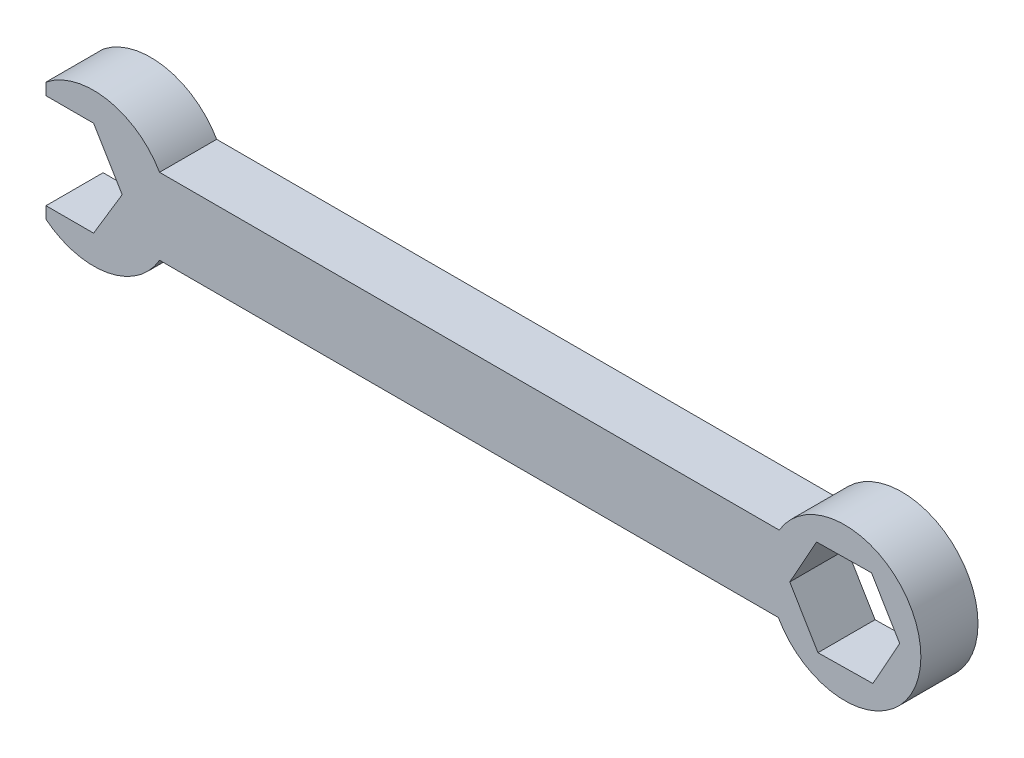
ISO-10303-21;
HEADER;
FILE_DESCRIPTION(('STEP AP214'),'2;1');
FILE_NAME('part.step','',(''),(''),'','','');
FILE_SCHEMA(('AUTOMOTIVE_DESIGN { 1 0 10303 214 1 1 1 1 }'));
ENDSEC;
DATA;
#1=APPLICATION_CONTEXT('core data for automotive mechanical design processes');
#2=APPLICATION_PROTOCOL_DEFINITION('international standard','automotive_design',2000,#1);
#3=PRODUCT_CONTEXT('',#1,'mechanical');
#4=PRODUCT('Part','Part','',(#3));
#5=PRODUCT_RELATED_PRODUCT_CATEGORY('part','',(#4));
#6=PRODUCT_DEFINITION_FORMATION('','',#4);
#7=PRODUCT_DEFINITION_CONTEXT('part definition',#1,'design');
#8=PRODUCT_DEFINITION('design','',#6,#7);
#9=PRODUCT_DEFINITION_SHAPE('','',#8);
#10=(LENGTH_UNIT() NAMED_UNIT(*) SI_UNIT(.MILLI.,.METRE.));
#11=(NAMED_UNIT(*) PLANE_ANGLE_UNIT() SI_UNIT($,.RADIAN.));
#12=(NAMED_UNIT(*) SI_UNIT($,.STERADIAN.) SOLID_ANGLE_UNIT());
#13=UNCERTAINTY_MEASURE_WITH_UNIT(LENGTH_MEASURE(1.E-05),#10,'distance_accuracy_value','');
#14=(GEOMETRIC_REPRESENTATION_CONTEXT(3) GLOBAL_UNCERTAINTY_ASSIGNED_CONTEXT((#13)) GLOBAL_UNIT_ASSIGNED_CONTEXT((#10,
#11,#12)) REPRESENTATION_CONTEXT('',''));
#15=CARTESIAN_POINT('',(0.,0.,0.));
#16=DIRECTION('',(0.,0.,1.));
#17=DIRECTION('',(1.,0.,0.));
#18=AXIS2_PLACEMENT_3D('',#15,#16,#17);
#19=CARTESIAN_POINT('',(-3.81,0.,7.62));
#20=DIRECTION('',(0.,0.,1.));
#21=DIRECTION('',(1.,0.,0.));
#22=AXIS2_PLACEMENT_3D('',#19,#20,#21);
#23=PLANE('',#22);
#24=DIRECTION('',(-0.514495755427526,-0.857492925712544,0.));
#25=VECTOR('',#24,1.);
#26=CARTESIAN_POINT('',(0.,0.,7.62));
#27=LINE('',#26,#25);
#28=CARTESIAN_POINT('',(0.,0.,7.62));
#29=VERTEX_POINT('',#28);
#30=CARTESIAN_POINT('',(-3.81,-6.35,7.62));
#31=VERTEX_POINT('',#30);
#32=EDGE_CURVE('E232',#29,#31,#27,.T.);
#33=ORIENTED_EDGE('',*,*,#32,.T.);
#34=DIRECTION('',(-1.,0.,0.));
#35=VECTOR('',#34,1.);
#36=CARTESIAN_POINT('',(-10.16,-6.35,7.62));
#37=LINE('',#36,#35);
#38=CARTESIAN_POINT('',(-10.16,-6.35,7.62));
#39=VERTEX_POINT('',#38);
#40=EDGE_CURVE('E236',#31,#39,#37,.T.);
#41=ORIENTED_EDGE('',*,*,#40,.T.);
#42=DIRECTION('',(0.,-1.,0.));
#43=VECTOR('',#42,1.);
#44=CARTESIAN_POINT('',(-10.16,-6.35,7.62));
#45=LINE('',#44,#43);
#46=CARTESIAN_POINT('',(-10.16,-7.93114745796597,7.62));
#47=VERTEX_POINT('',#46);
#48=EDGE_CURVE('E240',#39,#47,#45,.T.);
#49=ORIENTED_EDGE('',*,*,#48,.T.);
#50=CARTESIAN_POINT('',(-3.81,0.,7.62));
#51=DIRECTION('',(0.,0.,1.));
#52=DIRECTION('',(1.,0.,0.));
#53=AXIS2_PLACEMENT_3D('',#50,#51,#52);
#54=CIRCLE('',#53,10.16);
#55=CARTESIAN_POINT('',(4.9888181024499,-5.08,7.62));
#56=VERTEX_POINT('',#55);
#57=EDGE_CURVE('E243',#47,#56,#54,.T.);
#58=ORIENTED_EDGE('',*,*,#57,.T.);
#59=DIRECTION('',(1.,0.,0.));
#60=VECTOR('',#59,1.);
#61=CARTESIAN_POINT('',(4.9888181024499,-5.08,7.62));
#62=LINE('',#61,#60);
#63=CARTESIAN_POINT('',(87.5388181024499,-5.08,7.62));
#64=VERTEX_POINT('',#63);
#65=EDGE_CURVE('E246',#56,#64,#62,.T.);
#66=ORIENTED_EDGE('',*,*,#65,.T.);
#67=CARTESIAN_POINT('',(96.396398055742,-0.103165928922526,7.62));
#68=DIRECTION('',(0.,0.,1.));
#69=DIRECTION('',(1.,0.,0.));
#70=AXIS2_PLACEMENT_3D('',#67,#68,#69);
#71=CIRCLE('',#70,10.16);
#72=CARTESIAN_POINT('',(87.6579547760007,5.08,7.62));
#73=VERTEX_POINT('',#72);
#74=EDGE_CURVE('E249',#64,#73,#71,.T.);
#75=ORIENTED_EDGE('',*,*,#74,.T.);
#76=DIRECTION('',(-1.,0.,0.));
#77=VECTOR('',#76,1.);
#78=CARTESIAN_POINT('',(4.9888181024499,5.08,7.62));
#79=LINE('',#78,#77);
#80=CARTESIAN_POINT('',(4.9888181024499,5.08,7.62));
#81=VERTEX_POINT('',#80);
#82=EDGE_CURVE('E252',#73,#81,#79,.T.);
#83=ORIENTED_EDGE('',*,*,#82,.T.);
#84=CARTESIAN_POINT('',(-3.81,0.,7.62));
#85=DIRECTION('',(0.,0.,1.));
#86=DIRECTION('',(1.,0.,0.));
#87=AXIS2_PLACEMENT_3D('',#84,#85,#86);
#88=CIRCLE('',#87,10.16);
#89=CARTESIAN_POINT('',(-10.16,7.93114745796597,7.62));
#90=VERTEX_POINT('',#89);
#91=EDGE_CURVE('E255',#81,#90,#88,.T.);
#92=ORIENTED_EDGE('',*,*,#91,.T.);
#93=DIRECTION('',(0.,-1.,0.));
#94=VECTOR('',#93,1.);
#95=CARTESIAN_POINT('',(-10.16,6.35,7.62));
#96=LINE('',#95,#94);
#97=CARTESIAN_POINT('',(-10.16,6.35,7.62));
#98=VERTEX_POINT('',#97);
#99=EDGE_CURVE('E258',#90,#98,#96,.T.);
#100=ORIENTED_EDGE('',*,*,#99,.T.);
#101=DIRECTION('',(1.,0.,0.));
#102=VECTOR('',#101,1.);
#103=CARTESIAN_POINT('',(-10.16,6.35,7.62));
#104=LINE('',#103,#102);
#105=CARTESIAN_POINT('',(-3.81,6.35,7.62));
#106=VERTEX_POINT('',#105);
#107=EDGE_CURVE('E261',#98,#106,#104,.T.);
#108=ORIENTED_EDGE('',*,*,#107,.T.);
#109=DIRECTION('',(0.514495755427527,-0.857492925712544,0.));
#110=VECTOR('',#109,1.);
#111=CARTESIAN_POINT('',(-3.81,6.35,7.62));
#112=LINE('',#111,#110);
#113=EDGE_CURVE('E264',#106,#29,#112,.T.);
#114=ORIENTED_EDGE('',*,*,#113,.T.);
#115=EDGE_LOOP('',(#33,#41,#49,#58,#66,#75,#83,#92,#100,#108,#114));
#116=FACE_BOUND('',#115,.T.);
#117=DIRECTION('',(0.487558828947754,0.873090137566045,0.));
#118=VECTOR('',#117,1.);
#119=CARTESIAN_POINT('',(100.153044825055,-6.4000650375269,7.62));
#120=LINE('',#119,#118);
#121=CARTESIAN_POINT('',(100.153044825055,-6.4000650375269,7.62));
#122=VERTEX_POINT('',#121);
#123=CARTESIAN_POINT('',(103.727996033518,0.00173605204531834,7.62));
#124=VERTEX_POINT('',#123);
#125=EDGE_CURVE('E172',#122,#124,#120,.T.);
#126=ORIENTED_EDGE('',*,*,#125,.F.);
#127=DIRECTION('',(0.999897653399722,0.0143067370748756,0.));
#128=VECTOR('',#127,1.);
#129=CARTESIAN_POINT('',(92.8214468472797,-6.50496701849473,7.62));
#130=LINE('',#129,#128);
#131=CARTESIAN_POINT('',(92.8214468472797,-6.50496701849473,7.62));
#132=VERTEX_POINT('',#131);
#133=EDGE_CURVE('E163',#132,#122,#130,.T.);
#134=ORIENTED_EDGE('',*,*,#133,.F.);
#135=DIRECTION('',(0.512338824451969,-0.858783400491168,0.));
#136=VECTOR('',#135,1.);
#137=CARTESIAN_POINT('',(89.0648000779664,-0.20806790989037,7.62));
#138=LINE('',#137,#136);
#139=CARTESIAN_POINT('',(89.0648000779664,-0.208067909890364,7.62));
#140=VERTEX_POINT('',#139);
#141=EDGE_CURVE('E198',#140,#132,#138,.T.);
#142=ORIENTED_EDGE('',*,*,#141,.F.);
#143=DIRECTION('',(-0.487558828947752,-0.873090137566046,0.));
#144=VECTOR('',#143,1.);
#145=CARTESIAN_POINT('',(92.6397512864287,6.19373317968181,7.62));
#146=LINE('',#145,#144);
#147=CARTESIAN_POINT('',(92.6397512864287,6.19373317968181,7.62));
#148=VERTEX_POINT('',#147);
#149=EDGE_CURVE('E195',#148,#140,#146,.T.);
#150=ORIENTED_EDGE('',*,*,#149,.F.);
#151=DIRECTION('',(-0.999897653399722,-0.014306737074879,0.));
#152=VECTOR('',#151,1.);
#153=CARTESIAN_POINT('',(99.9713492642043,6.29863516064968,7.62));
#154=LINE('',#153,#152);
#155=CARTESIAN_POINT('',(99.9713492642043,6.29863516064968,7.62));
#156=VERTEX_POINT('',#155);
#157=EDGE_CURVE('E190',#156,#148,#154,.T.);
#158=ORIENTED_EDGE('',*,*,#157,.F.);
#159=DIRECTION('',(-0.512338824451972,0.858783400491167,0.));
#160=VECTOR('',#159,1.);
#161=CARTESIAN_POINT('',(103.727996033518,0.00173605204531834,7.62));
#162=LINE('',#161,#160);
#163=EDGE_CURVE('E186',#124,#156,#162,.T.);
#164=ORIENTED_EDGE('',*,*,#163,.F.);
#165=EDGE_LOOP('',(#126,#134,#142,#150,#158,#164));
#166=FACE_BOUND('',#165,.T.);
#167=ADVANCED_FACE('F43',(#116,#166),#23,.T.);
#168=CARTESIAN_POINT('',(-3.81,0.,0.));
#169=DIRECTION('',(0.,0.,1.));
#170=DIRECTION('',(1.,0.,0.));
#171=AXIS2_PLACEMENT_3D('',#168,#169,#170);
#172=PLANE('',#171);
#173=DIRECTION('',(-0.514495755427526,-0.857492925712544,0.));
#174=VECTOR('',#173,1.);
#175=CARTESIAN_POINT('',(0.,0.,0.));
#176=LINE('',#175,#174);
#177=CARTESIAN_POINT('',(0.,0.,0.));
#178=VERTEX_POINT('',#177);
#179=CARTESIAN_POINT('',(-3.81,-6.35,0.));
#180=VERTEX_POINT('',#179);
#181=EDGE_CURVE('E181',#178,#180,#176,.T.);
#182=ORIENTED_EDGE('',*,*,#181,.F.);
#183=DIRECTION('',(0.514495755427527,-0.857492925712544,0.));
#184=VECTOR('',#183,1.);
#185=CARTESIAN_POINT('',(-3.81,6.35,0.));
#186=LINE('',#185,#184);
#187=CARTESIAN_POINT('',(-3.81,6.35,0.));
#188=VERTEX_POINT('',#187);
#189=EDGE_CURVE('E237',#188,#178,#186,.T.);
#190=ORIENTED_EDGE('',*,*,#189,.F.);
#191=DIRECTION('',(1.,0.,0.));
#192=VECTOR('',#191,1.);
#193=CARTESIAN_POINT('',(-10.16,6.35,0.));
#194=LINE('',#193,#192);
#195=CARTESIAN_POINT('',(-10.16,6.35,0.));
#196=VERTEX_POINT('',#195);
#197=EDGE_CURVE('E295',#196,#188,#194,.T.);
#198=ORIENTED_EDGE('',*,*,#197,.F.);
#199=DIRECTION('',(0.,-1.,0.));
#200=VECTOR('',#199,1.);
#201=CARTESIAN_POINT('',(-10.16,6.35,0.));
#202=LINE('',#201,#200);
#203=CARTESIAN_POINT('',(-10.16,7.93114745796597,0.));
#204=VERTEX_POINT('',#203);
#205=EDGE_CURVE('E292',#204,#196,#202,.T.);
#206=ORIENTED_EDGE('',*,*,#205,.F.);
#207=CARTESIAN_POINT('',(-3.81,0.,0.));
#208=DIRECTION('',(0.,0.,1.));
#209=DIRECTION('',(1.,0.,0.));
#210=AXIS2_PLACEMENT_3D('',#207,#208,#209);
#211=CIRCLE('',#210,10.16);
#212=CARTESIAN_POINT('',(4.9888181024499,5.08,0.));
#213=VERTEX_POINT('',#212);
#214=EDGE_CURVE('E289',#213,#204,#211,.T.);
#215=ORIENTED_EDGE('',*,*,#214,.F.);
#216=DIRECTION('',(-1.,0.,0.));
#217=VECTOR('',#216,1.);
#218=CARTESIAN_POINT('',(4.9888181024499,5.08,0.));
#219=LINE('',#218,#217);
#220=CARTESIAN_POINT('',(87.6579547760007,5.08,0.));
#221=VERTEX_POINT('',#220);
#222=EDGE_CURVE('E286',#221,#213,#219,.T.);
#223=ORIENTED_EDGE('',*,*,#222,.F.);
#224=CARTESIAN_POINT('',(96.396398055742,-0.103165928922526,0.));
#225=DIRECTION('',(0.,0.,1.));
#226=DIRECTION('',(1.,0.,0.));
#227=AXIS2_PLACEMENT_3D('',#224,#225,#226);
#228=CIRCLE('',#227,10.16);
#229=CARTESIAN_POINT('',(87.5388181024499,-5.08,0.));
#230=VERTEX_POINT('',#229);
#231=EDGE_CURVE('E283',#230,#221,#228,.T.);
#232=ORIENTED_EDGE('',*,*,#231,.F.);
#233=DIRECTION('',(1.,0.,0.));
#234=VECTOR('',#233,1.);
#235=CARTESIAN_POINT('',(4.9888181024499,-5.08,0.));
#236=LINE('',#235,#234);
#237=CARTESIAN_POINT('',(4.9888181024499,-5.08,0.));
#238=VERTEX_POINT('',#237);
#239=EDGE_CURVE('E280',#238,#230,#236,.T.);
#240=ORIENTED_EDGE('',*,*,#239,.F.);
#241=CARTESIAN_POINT('',(-3.81,0.,0.));
#242=DIRECTION('',(0.,0.,1.));
#243=DIRECTION('',(1.,0.,0.));
#244=AXIS2_PLACEMENT_3D('',#241,#242,#243);
#245=CIRCLE('',#244,10.16);
#246=CARTESIAN_POINT('',(-10.16,-7.93114745796597,0.));
#247=VERTEX_POINT('',#246);
#248=EDGE_CURVE('E277',#247,#238,#245,.T.);
#249=ORIENTED_EDGE('',*,*,#248,.F.);
#250=DIRECTION('',(0.,-1.,0.));
#251=VECTOR('',#250,1.);
#252=CARTESIAN_POINT('',(-10.16,-6.35,0.));
#253=LINE('',#252,#251);
#254=CARTESIAN_POINT('',(-10.16,-6.35,0.));
#255=VERTEX_POINT('',#254);
#256=EDGE_CURVE('E274',#255,#247,#253,.T.);
#257=ORIENTED_EDGE('',*,*,#256,.F.);
#258=DIRECTION('',(-1.,0.,0.));
#259=VECTOR('',#258,1.);
#260=CARTESIAN_POINT('',(-10.16,-6.35,0.));
#261=LINE('',#260,#259);
#262=EDGE_CURVE('E271',#180,#255,#261,.T.);
#263=ORIENTED_EDGE('',*,*,#262,.F.);
#264=EDGE_LOOP('',(#182,#190,#198,#206,#215,#223,#232,#240,#249,#257,#263));
#265=FACE_BOUND('',#264,.T.);
#266=DIRECTION('',(0.999897653399722,0.0143067370748756,0.));
#267=VECTOR('',#266,1.);
#268=CARTESIAN_POINT('',(92.8214468472797,-6.50496701849473,0.));
#269=LINE('',#268,#267);
#270=CARTESIAN_POINT('',(92.8214468472797,-6.50496701849473,0.));
#271=VERTEX_POINT('',#270);
#272=CARTESIAN_POINT('',(100.153044825055,-6.4000650375269,0.));
#273=VERTEX_POINT('',#272);
#274=EDGE_CURVE('E67',#271,#273,#269,.T.);
#275=ORIENTED_EDGE('',*,*,#274,.T.);
#276=DIRECTION('',(0.487558828947754,0.873090137566045,0.));
#277=VECTOR('',#276,1.);
#278=CARTESIAN_POINT('',(100.153044825055,-6.4000650375269,0.));
#279=LINE('',#278,#277);
#280=CARTESIAN_POINT('',(103.727996033518,0.00173605204531834,0.));
#281=VERTEX_POINT('',#280);
#282=EDGE_CURVE('E179',#273,#281,#279,.T.);
#283=ORIENTED_EDGE('',*,*,#282,.T.);
#284=DIRECTION('',(-0.512338824451972,0.858783400491167,0.));
#285=VECTOR('',#284,1.);
#286=CARTESIAN_POINT('',(103.727996033518,0.00173605204531834,0.));
#287=LINE('',#286,#285);
#288=CARTESIAN_POINT('',(99.9713492642043,6.29863516064968,0.));
#289=VERTEX_POINT('',#288);
#290=EDGE_CURVE('E205',#281,#289,#287,.T.);
#291=ORIENTED_EDGE('',*,*,#290,.T.);
#292=DIRECTION('',(-0.999897653399722,-0.014306737074879,0.));
#293=VECTOR('',#292,1.);
#294=CARTESIAN_POINT('',(99.9713492642043,6.29863516064968,0.));
#295=LINE('',#294,#293);
#296=CARTESIAN_POINT('',(92.6397512864287,6.19373317968181,0.));
#297=VERTEX_POINT('',#296);
#298=EDGE_CURVE('E209',#289,#297,#295,.T.);
#299=ORIENTED_EDGE('',*,*,#298,.T.);
#300=DIRECTION('',(-0.487558828947752,-0.873090137566046,0.));
#301=VECTOR('',#300,1.);
#302=CARTESIAN_POINT('',(92.6397512864287,6.19373317968181,0.));
#303=LINE('',#302,#301);
#304=CARTESIAN_POINT('',(89.0648000779664,-0.20806790989037,0.));
#305=VERTEX_POINT('',#304);
#306=EDGE_CURVE('E213',#297,#305,#303,.T.);
#307=ORIENTED_EDGE('',*,*,#306,.T.);
#308=DIRECTION('',(0.512338824451969,-0.858783400491168,0.));
#309=VECTOR('',#308,1.);
#310=CARTESIAN_POINT('',(89.0648000779664,-0.20806790989037,0.));
#311=LINE('',#310,#309);
#312=EDGE_CURVE('E173',#305,#271,#311,.T.);
#313=ORIENTED_EDGE('',*,*,#312,.T.);
#314=EDGE_LOOP('',(#275,#283,#291,#299,#307,#313));
#315=FACE_BOUND('',#314,.T.);
#316=ADVANCED_FACE('F346',(#265,#315),#172,.F.);
#317=CARTESIAN_POINT('',(0.,0.,7.62));
#318=DIRECTION('',(0.857492925712544,-0.514495755427526,0.));
#319=DIRECTION('',(0.514495755427526,0.857492925712544,0.));
#320=AXIS2_PLACEMENT_3D('',#317,#318,#319);
#321=PLANE('',#320);
#322=ORIENTED_EDGE('',*,*,#181,.T.);
#323=DIRECTION('',(0.,0.,-1.));
#324=VECTOR('',#323,1.);
#325=CARTESIAN_POINT('',(-3.81,-6.35,7.62));
#326=LINE('',#325,#324);
#327=EDGE_CURVE('E11',#31,#180,#326,.T.);
#328=ORIENTED_EDGE('',*,*,#327,.F.);
#329=ORIENTED_EDGE('',*,*,#32,.F.);
#330=DIRECTION('',(0.,0.,-1.));
#331=VECTOR('',#330,1.);
#332=CARTESIAN_POINT('',(0.,0.,7.62));
#333=LINE('',#332,#331);
#334=EDGE_CURVE('E267',#29,#178,#333,.T.);
#335=ORIENTED_EDGE('',*,*,#334,.T.);
#336=EDGE_LOOP('',(#322,#328,#329,#335));
#337=FACE_BOUND('',#336,.T.);
#338=ADVANCED_FACE('F45',(#337),#321,.F.);
#339=CARTESIAN_POINT('',(-10.16,-6.35,7.62));
#340=DIRECTION('',(0.,-1.,0.));
#341=DIRECTION('',(1.,0.,0.));
#342=AXIS2_PLACEMENT_3D('',#339,#340,#341);
#343=PLANE('',#342);
#344=ORIENTED_EDGE('',*,*,#262,.T.);
#345=DIRECTION('',(0.,0.,-1.));
#346=VECTOR('',#345,1.);
#347=CARTESIAN_POINT('',(-10.16,-6.35,7.62));
#348=LINE('',#347,#346);
#349=EDGE_CURVE('E52',#39,#255,#348,.T.);
#350=ORIENTED_EDGE('',*,*,#349,.F.);
#351=ORIENTED_EDGE('',*,*,#40,.F.);
#352=ORIENTED_EDGE('',*,*,#327,.T.);
#353=EDGE_LOOP('',(#344,#350,#351,#352));
#354=FACE_BOUND('',#353,.T.);
#355=ADVANCED_FACE('F363',(#354),#343,.F.);
#356=CARTESIAN_POINT('',(-10.16,-6.35,7.62));
#357=DIRECTION('',(1.,0.,0.));
#358=DIRECTION('',(0.,0.,-1.));
#359=AXIS2_PLACEMENT_3D('',#356,#357,#358);
#360=PLANE('',#359);
#361=ORIENTED_EDGE('',*,*,#256,.T.);
#362=DIRECTION('',(0.,0.,-1.));
#363=VECTOR('',#362,1.);
#364=CARTESIAN_POINT('',(-10.16,-7.93114745796597,7.62));
#365=LINE('',#364,#363);
#366=EDGE_CURVE('E331',#47,#247,#365,.T.);
#367=ORIENTED_EDGE('',*,*,#366,.F.);
#368=ORIENTED_EDGE('',*,*,#48,.F.);
#369=ORIENTED_EDGE('',*,*,#349,.T.);
#370=EDGE_LOOP('',(#361,#367,#368,#369));
#371=FACE_BOUND('',#370,.T.);
#372=ADVANCED_FACE('F340',(#371),#360,.F.);
#373=CARTESIAN_POINT('',(-3.81,0.,7.62));
#374=DIRECTION('',(0.,0.,-1.));
#375=DIRECTION('',(-1.,0.,0.));
#376=AXIS2_PLACEMENT_3D('',#373,#374,#375);
#377=CYLINDRICAL_SURFACE('',#376,10.16);
#378=ORIENTED_EDGE('',*,*,#248,.T.);
#379=DIRECTION('',(0.,0.,-1.));
#380=VECTOR('',#379,1.);
#381=CARTESIAN_POINT('',(4.9888181024499,-5.08,7.62));
#382=LINE('',#381,#380);
#383=EDGE_CURVE('E327',#56,#238,#382,.T.);
#384=ORIENTED_EDGE('',*,*,#383,.F.);
#385=ORIENTED_EDGE('',*,*,#57,.F.);
#386=ORIENTED_EDGE('',*,*,#366,.T.);
#387=EDGE_LOOP('',(#378,#384,#385,#386));
#388=FACE_BOUND('',#387,.T.);
#389=ADVANCED_FACE('F352',(#388),#377,.T.);
#390=CARTESIAN_POINT('',(4.9888181024499,-5.08,7.62));
#391=DIRECTION('',(0.,1.,0.));
#392=DIRECTION('',(0.,0.,1.));
#393=AXIS2_PLACEMENT_3D('',#390,#391,#392);
#394=PLANE('',#393);
#395=ORIENTED_EDGE('',*,*,#239,.T.);
#396=DIRECTION('',(0.,0.,-1.));
#397=VECTOR('',#396,1.);
#398=CARTESIAN_POINT('',(87.5388181024499,-5.08,7.62));
#399=LINE('',#398,#397);
#400=EDGE_CURVE('E323',#64,#230,#399,.T.);
#401=ORIENTED_EDGE('',*,*,#400,.F.);
#402=ORIENTED_EDGE('',*,*,#65,.F.);
#403=ORIENTED_EDGE('',*,*,#383,.T.);
#404=EDGE_LOOP('',(#395,#401,#402,#403));
#405=FACE_BOUND('',#404,.T.);
#406=ADVANCED_FACE('F356',(#405),#394,.F.);
#407=CARTESIAN_POINT('',(96.396398055742,-0.103165928922526,7.62));
#408=DIRECTION('',(0.,0.,-1.));
#409=DIRECTION('',(-1.,0.,0.));
#410=AXIS2_PLACEMENT_3D('',#407,#408,#409);
#411=CYLINDRICAL_SURFACE('',#410,10.16);
#412=ORIENTED_EDGE('',*,*,#231,.T.);
#413=DIRECTION('',(0.,0.,-1.));
#414=VECTOR('',#413,1.);
#415=CARTESIAN_POINT('',(87.6579547760007,5.08,7.62));
#416=LINE('',#415,#414);
#417=EDGE_CURVE('E319',#73,#221,#416,.T.);
#418=ORIENTED_EDGE('',*,*,#417,.F.);
#419=ORIENTED_EDGE('',*,*,#74,.F.);
#420=ORIENTED_EDGE('',*,*,#400,.T.);
#421=EDGE_LOOP('',(#412,#418,#419,#420));
#422=FACE_BOUND('',#421,.T.);
#423=ADVANCED_FACE('F391',(#422),#411,.T.);
#424=CARTESIAN_POINT('',(4.9888181024499,5.08,7.62));
#425=DIRECTION('',(0.,-1.,0.));
#426=DIRECTION('',(1.,0.,0.));
#427=AXIS2_PLACEMENT_3D('',#424,#425,#426);
#428=PLANE('',#427);
#429=ORIENTED_EDGE('',*,*,#222,.T.);
#430=DIRECTION('',(0.,0.,-1.));
#431=VECTOR('',#430,1.);
#432=CARTESIAN_POINT('',(4.9888181024499,5.08,7.62));
#433=LINE('',#432,#431);
#434=EDGE_CURVE('E315',#81,#213,#433,.T.);
#435=ORIENTED_EDGE('',*,*,#434,.F.);
#436=ORIENTED_EDGE('',*,*,#82,.F.);
#437=ORIENTED_EDGE('',*,*,#417,.T.);
#438=EDGE_LOOP('',(#429,#435,#436,#437));
#439=FACE_BOUND('',#438,.T.);
#440=ADVANCED_FACE('F389',(#439),#428,.F.);
#441=CARTESIAN_POINT('',(-3.81,0.,7.62));
#442=DIRECTION('',(0.,0.,-1.));
#443=DIRECTION('',(-1.,0.,0.));
#444=AXIS2_PLACEMENT_3D('',#441,#442,#443);
#445=CYLINDRICAL_SURFACE('',#444,10.16);
#446=ORIENTED_EDGE('',*,*,#214,.T.);
#447=DIRECTION('',(0.,0.,-1.));
#448=VECTOR('',#447,1.);
#449=CARTESIAN_POINT('',(-10.16,7.93114745796597,7.62));
#450=LINE('',#449,#448);
#451=EDGE_CURVE('E311',#90,#204,#450,.T.);
#452=ORIENTED_EDGE('',*,*,#451,.F.);
#453=ORIENTED_EDGE('',*,*,#91,.F.);
#454=ORIENTED_EDGE('',*,*,#434,.T.);
#455=EDGE_LOOP('',(#446,#452,#453,#454));
#456=FACE_BOUND('',#455,.T.);
#457=ADVANCED_FACE('F384',(#456),#445,.T.);
#458=CARTESIAN_POINT('',(-10.16,6.35,7.62));
#459=DIRECTION('',(1.,0.,0.));
#460=DIRECTION('',(0.,0.,-1.));
#461=AXIS2_PLACEMENT_3D('',#458,#459,#460);
#462=PLANE('',#461);
#463=ORIENTED_EDGE('',*,*,#205,.T.);
#464=DIRECTION('',(0.,0.,-1.));
#465=VECTOR('',#464,1.);
#466=CARTESIAN_POINT('',(-10.16,6.35,7.62));
#467=LINE('',#466,#465);
#468=EDGE_CURVE('E307',#98,#196,#467,.T.);
#469=ORIENTED_EDGE('',*,*,#468,.F.);
#470=ORIENTED_EDGE('',*,*,#99,.F.);
#471=ORIENTED_EDGE('',*,*,#451,.T.);
#472=EDGE_LOOP('',(#463,#469,#470,#471));
#473=FACE_BOUND('',#472,.T.);
#474=ADVANCED_FACE('F379',(#473),#462,.F.);
#475=CARTESIAN_POINT('',(-10.16,6.35,7.62));
#476=DIRECTION('',(0.,1.,0.));
#477=DIRECTION('',(0.,0.,1.));
#478=AXIS2_PLACEMENT_3D('',#475,#476,#477);
#479=PLANE('',#478);
#480=ORIENTED_EDGE('',*,*,#197,.T.);
#481=DIRECTION('',(0.,0.,-1.));
#482=VECTOR('',#481,1.);
#483=CARTESIAN_POINT('',(-3.81,6.35,7.62));
#484=LINE('',#483,#482);
#485=EDGE_CURVE('E303',#106,#188,#484,.T.);
#486=ORIENTED_EDGE('',*,*,#485,.F.);
#487=ORIENTED_EDGE('',*,*,#107,.F.);
#488=ORIENTED_EDGE('',*,*,#468,.T.);
#489=EDGE_LOOP('',(#480,#486,#487,#488));
#490=FACE_BOUND('',#489,.T.);
#491=ADVANCED_FACE('F375',(#490),#479,.F.);
#492=CARTESIAN_POINT('',(-3.81,6.35,7.62));
#493=DIRECTION('',(0.857492925712544,0.514495755427527,0.));
#494=DIRECTION('',(-0.514495755427527,0.857492925712544,0.));
#495=AXIS2_PLACEMENT_3D('',#492,#493,#494);
#496=PLANE('',#495);
#497=ORIENTED_EDGE('',*,*,#189,.T.);
#498=ORIENTED_EDGE('',*,*,#334,.F.);
#499=ORIENTED_EDGE('',*,*,#113,.F.);
#500=ORIENTED_EDGE('',*,*,#485,.T.);
#501=EDGE_LOOP('',(#497,#498,#499,#500));
#502=FACE_BOUND('',#501,.T.);
#503=ADVANCED_FACE('F370',(#502),#496,.F.);
#504=CARTESIAN_POINT('',(92.8214468472797,-6.50496701849473,7.62));
#505=DIRECTION('',(-0.0143067370748756,0.999897653399722,0.));
#506=DIRECTION('',(-0.999897653399722,-0.0143067370748756,0.));
#507=AXIS2_PLACEMENT_3D('',#504,#505,#506);
#508=PLANE('',#507);
#509=ORIENTED_EDGE('',*,*,#274,.F.);
#510=DIRECTION('',(0.,0.,-1.));
#511=VECTOR('',#510,1.);
#512=CARTESIAN_POINT('',(92.8214468472797,-6.50496701849473,7.62));
#513=LINE('',#512,#511);
#514=EDGE_CURVE('E167',#132,#271,#513,.T.);
#515=ORIENTED_EDGE('',*,*,#514,.F.);
#516=ORIENTED_EDGE('',*,*,#133,.T.);
#517=DIRECTION('',(0.,0.,-1.));
#518=VECTOR('',#517,1.);
#519=CARTESIAN_POINT('',(100.153044825055,-6.4000650375269,7.62));
#520=LINE('',#519,#518);
#521=EDGE_CURVE('E166',#122,#273,#520,.T.);
#522=ORIENTED_EDGE('',*,*,#521,.T.);
#523=EDGE_LOOP('',(#509,#515,#516,#522));
#524=FACE_BOUND('',#523,.T.);
#525=ADVANCED_FACE('F165',(#524),#508,.T.);
#526=CARTESIAN_POINT('',(100.153044825055,-6.4000650375269,7.62));
#527=DIRECTION('',(-0.873090137566045,0.487558828947754,0.));
#528=DIRECTION('',(-0.487558828947754,-0.873090137566045,0.));
#529=AXIS2_PLACEMENT_3D('',#526,#527,#528);
#530=PLANE('',#529);
#531=ORIENTED_EDGE('',*,*,#282,.F.);
#532=ORIENTED_EDGE('',*,*,#521,.F.);
#533=ORIENTED_EDGE('',*,*,#125,.T.);
#534=DIRECTION('',(0.,0.,-1.));
#535=VECTOR('',#534,1.);
#536=CARTESIAN_POINT('',(103.727996033518,0.00173605204531834,7.62));
#537=LINE('',#536,#535);
#538=EDGE_CURVE('E182',#124,#281,#537,.T.);
#539=ORIENTED_EDGE('',*,*,#538,.T.);
#540=EDGE_LOOP('',(#531,#532,#533,#539));
#541=FACE_BOUND('',#540,.T.);
#542=ADVANCED_FACE('F176',(#541),#530,.T.);
#543=CARTESIAN_POINT('',(103.727996033518,0.00173605204531834,7.62));
#544=DIRECTION('',(-0.858783400491167,-0.512338824451972,0.));
#545=DIRECTION('',(0.512338824451972,-0.858783400491167,0.));
#546=AXIS2_PLACEMENT_3D('',#543,#544,#545);
#547=PLANE('',#546);
#548=ORIENTED_EDGE('',*,*,#290,.F.);
#549=ORIENTED_EDGE('',*,*,#538,.F.);
#550=ORIENTED_EDGE('',*,*,#163,.T.);
#551=DIRECTION('',(0.,0.,-1.));
#552=VECTOR('',#551,1.);
#553=CARTESIAN_POINT('',(99.9713492642043,6.29863516064968,7.62));
#554=LINE('',#553,#552);
#555=EDGE_CURVE('E227',#156,#289,#554,.T.);
#556=ORIENTED_EDGE('',*,*,#555,.T.);
#557=EDGE_LOOP('',(#548,#549,#550,#556));
#558=FACE_BOUND('',#557,.T.);
#559=ADVANCED_FACE('F443',(#558),#547,.T.);
#560=CARTESIAN_POINT('',(99.9713492642043,6.29863516064968,7.62));
#561=DIRECTION('',(0.014306737074879,-0.999897653399722,0.));
#562=DIRECTION('',(0.999897653399722,0.0143067370748791,0.));
#563=AXIS2_PLACEMENT_3D('',#560,#561,#562);
#564=PLANE('',#563);
#565=ORIENTED_EDGE('',*,*,#298,.F.);
#566=ORIENTED_EDGE('',*,*,#555,.F.);
#567=ORIENTED_EDGE('',*,*,#157,.T.);
#568=DIRECTION('',(0.,0.,-1.));
#569=VECTOR('',#568,1.);
#570=CARTESIAN_POINT('',(92.6397512864287,6.19373317968181,7.62));
#571=LINE('',#570,#569);
#572=EDGE_CURVE('E224',#148,#297,#571,.T.);
#573=ORIENTED_EDGE('',*,*,#572,.T.);
#574=EDGE_LOOP('',(#565,#566,#567,#573));
#575=FACE_BOUND('',#574,.T.);
#576=ADVANCED_FACE('F449',(#575),#564,.T.);
#577=CARTESIAN_POINT('',(92.6397512864287,6.19373317968181,7.62));
#578=DIRECTION('',(0.873090137566046,-0.487558828947752,0.));
#579=DIRECTION('',(0.487558828947752,0.873090137566046,0.));
#580=AXIS2_PLACEMENT_3D('',#577,#578,#579);
#581=PLANE('',#580);
#582=ORIENTED_EDGE('',*,*,#306,.F.);
#583=ORIENTED_EDGE('',*,*,#572,.F.);
#584=ORIENTED_EDGE('',*,*,#149,.T.);
#585=DIRECTION('',(0.,0.,-1.));
#586=VECTOR('',#585,1.);
#587=CARTESIAN_POINT('',(89.0648000779664,-0.20806790989037,7.62));
#588=LINE('',#587,#586);
#589=EDGE_CURVE('E59',#140,#305,#588,.T.);
#590=ORIENTED_EDGE('',*,*,#589,.T.);
#591=EDGE_LOOP('',(#582,#583,#584,#590));
#592=FACE_BOUND('',#591,.T.);
#593=ADVANCED_FACE('F457',(#592),#581,.T.);
#594=CARTESIAN_POINT('',(89.0648000779664,-0.20806790989037,7.62));
#595=DIRECTION('',(0.858783400491168,0.512338824451969,0.));
#596=DIRECTION('',(-0.512338824451969,0.858783400491169,0.));
#597=AXIS2_PLACEMENT_3D('',#594,#595,#596);
#598=PLANE('',#597);
#599=ORIENTED_EDGE('',*,*,#312,.F.);
#600=ORIENTED_EDGE('',*,*,#589,.F.);
#601=ORIENTED_EDGE('',*,*,#141,.T.);
#602=ORIENTED_EDGE('',*,*,#514,.T.);
#603=EDGE_LOOP('',(#599,#600,#601,#602));
#604=FACE_BOUND('',#603,.T.);
#605=ADVANCED_FACE('F465',(#604),#598,.T.);
#606=CLOSED_SHELL('',(#167,#316,#338,#355,#372,#389,#406,#423,#440,#457,#474,#491,#503,#525,
#542,#559,#576,#593,#605));
#607=MANIFOLD_SOLID_BREP('B2',#606);
#608=ADVANCED_BREP_SHAPE_REPRESENTATION('',(#18,#607),#14);
#609=SHAPE_DEFINITION_REPRESENTATION(#9,#608);
ENDSEC;
END-ISO-10303-21;
